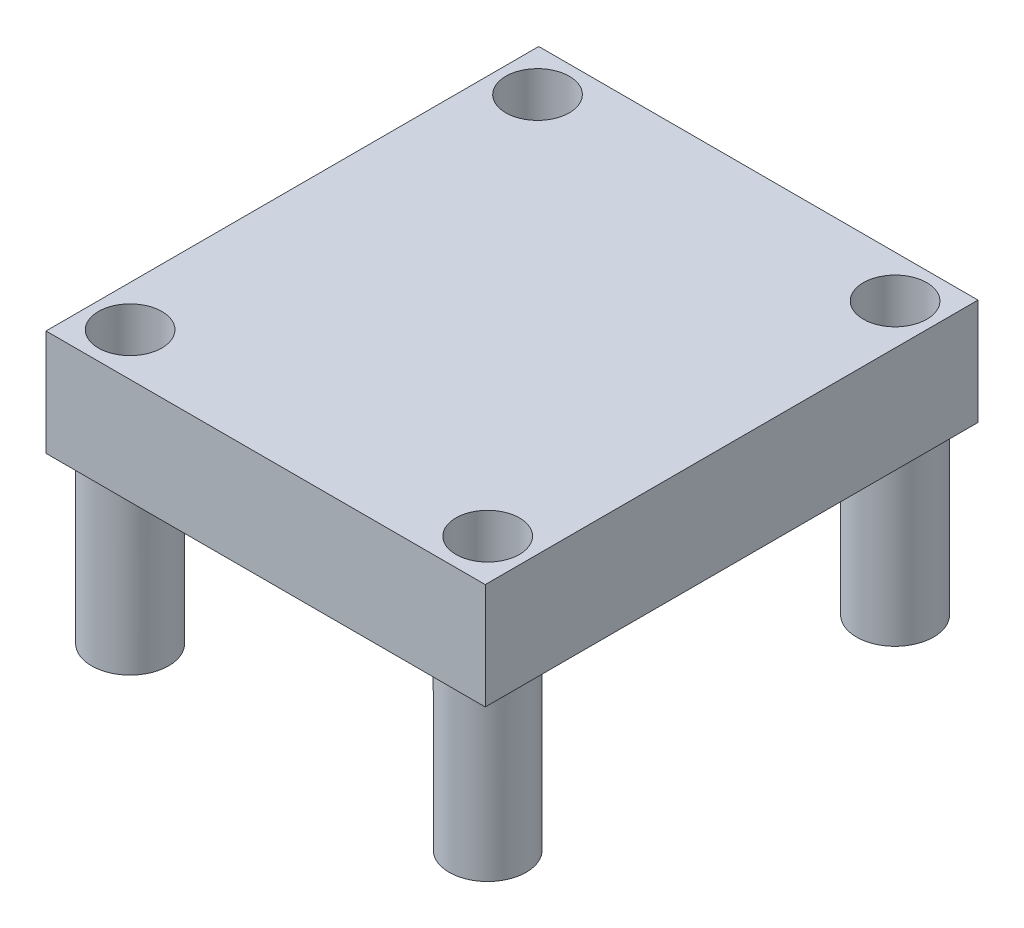
ISO-10303-21;
HEADER;
FILE_DESCRIPTION(('STEP AP214'),'2;1');
FILE_NAME('part.step','',(''),(''),'','','');
FILE_SCHEMA(('AUTOMOTIVE_DESIGN { 1 0 10303 214 1 1 1 1 }'));
ENDSEC;
DATA;
#1=APPLICATION_CONTEXT('core data for automotive mechanical design processes');
#2=APPLICATION_PROTOCOL_DEFINITION('international standard','automotive_design',2000,#1);
#3=PRODUCT_CONTEXT('',#1,'mechanical');
#4=PRODUCT('Part','Part','',(#3));
#5=PRODUCT_RELATED_PRODUCT_CATEGORY('part','',(#4));
#6=PRODUCT_DEFINITION_FORMATION('','',#4);
#7=PRODUCT_DEFINITION_CONTEXT('part definition',#1,'design');
#8=PRODUCT_DEFINITION('design','',#6,#7);
#9=PRODUCT_DEFINITION_SHAPE('','',#8);
#10=(LENGTH_UNIT() NAMED_UNIT(*) SI_UNIT(.MILLI.,.METRE.));
#11=(NAMED_UNIT(*) PLANE_ANGLE_UNIT() SI_UNIT($,.RADIAN.));
#12=(NAMED_UNIT(*) SI_UNIT($,.STERADIAN.) SOLID_ANGLE_UNIT());
#13=UNCERTAINTY_MEASURE_WITH_UNIT(LENGTH_MEASURE(1.E-05),#10,'distance_accuracy_value','');
#14=(GEOMETRIC_REPRESENTATION_CONTEXT(3) GLOBAL_UNCERTAINTY_ASSIGNED_CONTEXT((#13)) GLOBAL_UNIT_ASSIGNED_CONTEXT((#10,
#11,#12)) REPRESENTATION_CONTEXT('',''));
#15=CARTESIAN_POINT('',(0.,0.,0.));
#16=DIRECTION('',(0.,0.,1.));
#17=DIRECTION('',(1.,0.,0.));
#18=AXIS2_PLACEMENT_3D('',#15,#16,#17);
#19=CARTESIAN_POINT('',(-11.3076995509559,5.4864,-1.67311031433089));
#20=DIRECTION('',(0.,0.,1.));
#21=DIRECTION('',(1.,0.,0.));
#22=AXIS2_PLACEMENT_3D('',#19,#20,#21);
#23=PLANE('',#22);
#24=DIRECTION('',(-1.,0.,0.));
#25=VECTOR('',#24,1.);
#26=CARTESIAN_POINT('',(-11.3076995509559,0.,-1.67311031433089));
#27=LINE('',#26,#25);
#28=CARTESIAN_POINT('',(-11.3076995509559,0.,-1.67311031433089));
#29=VERTEX_POINT('',#28);
#30=CARTESIAN_POINT('',(-34.0406995509559,0.,-1.67311031433089));
#31=VERTEX_POINT('',#30);
#32=EDGE_CURVE('E103',#29,#31,#27,.T.);
#33=ORIENTED_EDGE('',*,*,#32,.T.);
#34=DIRECTION('',(0.,-1.,0.));
#35=VECTOR('',#34,1.);
#36=CARTESIAN_POINT('',(-34.0406995509559,5.4864,-1.67311031433089));
#37=LINE('',#36,#35);
#38=CARTESIAN_POINT('',(-34.0406995509559,5.4864,-1.67311031433089));
#39=VERTEX_POINT('',#38);
#40=EDGE_CURVE('E94',#39,#31,#37,.T.);
#41=ORIENTED_EDGE('',*,*,#40,.F.);
#42=DIRECTION('',(-1.,0.,0.));
#43=VECTOR('',#42,1.);
#44=CARTESIAN_POINT('',(-11.3076995509559,5.4864,-1.67311031433089));
#45=LINE('',#44,#43);
#46=CARTESIAN_POINT('',(-11.3076995509559,5.4864,-1.67311031433089));
#47=VERTEX_POINT('',#46);
#48=EDGE_CURVE('E88',#47,#39,#45,.T.);
#49=ORIENTED_EDGE('',*,*,#48,.F.);
#50=DIRECTION('',(0.,-1.,0.));
#51=VECTOR('',#50,1.);
#52=CARTESIAN_POINT('',(-11.3076995509559,5.4864,-1.67311031433089));
#53=LINE('',#52,#51);
#54=EDGE_CURVE('E99',#47,#29,#53,.T.);
#55=ORIENTED_EDGE('',*,*,#54,.T.);
#56=EDGE_LOOP('',(#33,#41,#49,#55));
#57=FACE_BOUND('',#56,.T.);
#58=ADVANCED_FACE('F36',(#57),#23,.F.);
#59=CARTESIAN_POINT('',(-34.0406995509559,5.4864,-1.67311031433089));
#60=DIRECTION('',(1.,0.,0.));
#61=DIRECTION('',(0.,0.,-1.));
#62=AXIS2_PLACEMENT_3D('',#59,#60,#61);
#63=PLANE('',#62);
#64=DIRECTION('',(0.,0.,1.));
#65=VECTOR('',#64,1.);
#66=CARTESIAN_POINT('',(-34.0406995509559,0.,-1.67311031433089));
#67=LINE('',#66,#65);
#68=CARTESIAN_POINT('',(-34.0406995509559,0.,23.8284896856691));
#69=VERTEX_POINT('',#68);
#70=EDGE_CURVE('E93',#31,#69,#67,.T.);
#71=ORIENTED_EDGE('',*,*,#70,.T.);
#72=DIRECTION('',(0.,-1.,0.));
#73=VECTOR('',#72,1.);
#74=CARTESIAN_POINT('',(-34.0406995509559,5.4864,23.8284896856691));
#75=LINE('',#74,#73);
#76=CARTESIAN_POINT('',(-34.0406995509559,5.4864,23.8284896856691));
#77=VERTEX_POINT('',#76);
#78=EDGE_CURVE('E91',#77,#69,#75,.T.);
#79=ORIENTED_EDGE('',*,*,#78,.F.);
#80=DIRECTION('',(0.,0.,1.));
#81=VECTOR('',#80,1.);
#82=CARTESIAN_POINT('',(-34.0406995509559,5.4864,-1.67311031433089));
#83=LINE('',#82,#81);
#84=EDGE_CURVE('E83',#39,#77,#83,.T.);
#85=ORIENTED_EDGE('',*,*,#84,.F.);
#86=ORIENTED_EDGE('',*,*,#40,.T.);
#87=EDGE_LOOP('',(#71,#79,#85,#86));
#88=FACE_BOUND('',#87,.T.);
#89=ADVANCED_FACE('F92',(#88),#63,.F.);
#90=CARTESIAN_POINT('',(-34.0406995509559,5.4864,23.8284896856691));
#91=DIRECTION('',(0.,0.,-1.));
#92=DIRECTION('',(-1.,0.,0.));
#93=AXIS2_PLACEMENT_3D('',#90,#91,#92);
#94=PLANE('',#93);
#95=DIRECTION('',(1.,0.,0.));
#96=VECTOR('',#95,1.);
#97=CARTESIAN_POINT('',(-34.0406995509559,0.,23.8284896856691));
#98=LINE('',#97,#96);
#99=CARTESIAN_POINT('',(-11.3076995509559,0.,23.8284896856691));
#100=VERTEX_POINT('',#99);
#101=EDGE_CURVE('E69',#69,#100,#98,.T.);
#102=ORIENTED_EDGE('',*,*,#101,.T.);
#103=DIRECTION('',(0.,-1.,0.));
#104=VECTOR('',#103,1.);
#105=CARTESIAN_POINT('',(-11.3076995509559,5.4864,23.8284896856691));
#106=LINE('',#105,#104);
#107=CARTESIAN_POINT('',(-11.3076995509559,5.4864,23.8284896856691));
#108=VERTEX_POINT('',#107);
#109=EDGE_CURVE('E95',#108,#100,#106,.T.);
#110=ORIENTED_EDGE('',*,*,#109,.F.);
#111=DIRECTION('',(1.,0.,0.));
#112=VECTOR('',#111,1.);
#113=CARTESIAN_POINT('',(-34.0406995509559,5.4864,23.8284896856691));
#114=LINE('',#113,#112);
#115=EDGE_CURVE('E86',#77,#108,#114,.T.);
#116=ORIENTED_EDGE('',*,*,#115,.F.);
#117=ORIENTED_EDGE('',*,*,#78,.T.);
#118=EDGE_LOOP('',(#102,#110,#116,#117));
#119=FACE_BOUND('',#118,.T.);
#120=ADVANCED_FACE('F97',(#119),#94,.F.);
#121=CARTESIAN_POINT('',(-11.3076995509559,5.4864,23.8284896856691));
#122=DIRECTION('',(-1.,0.,0.));
#123=DIRECTION('',(0.,0.,1.));
#124=AXIS2_PLACEMENT_3D('',#121,#122,#123);
#125=PLANE('',#124);
#126=DIRECTION('',(0.,0.,-1.));
#127=VECTOR('',#126,1.);
#128=CARTESIAN_POINT('',(-11.3076995509559,0.,23.8284896856691));
#129=LINE('',#128,#127);
#130=EDGE_CURVE('E75',#100,#29,#129,.T.);
#131=ORIENTED_EDGE('',*,*,#130,.T.);
#132=ORIENTED_EDGE('',*,*,#54,.F.);
#133=DIRECTION('',(0.,0.,-1.));
#134=VECTOR('',#133,1.);
#135=CARTESIAN_POINT('',(-11.3076995509559,5.4864,23.8284896856691));
#136=LINE('',#135,#134);
#137=EDGE_CURVE('E52',#108,#47,#136,.T.);
#138=ORIENTED_EDGE('',*,*,#137,.F.);
#139=ORIENTED_EDGE('',*,*,#109,.T.);
#140=EDGE_LOOP('',(#131,#132,#138,#139));
#141=FACE_BOUND('',#140,.T.);
#142=ADVANCED_FACE('F135',(#141),#125,.F.);
#143=CARTESIAN_POINT('',(0.,5.4864,0.));
#144=DIRECTION('',(0.,1.,0.));
#145=DIRECTION('',(0.,0.,1.));
#146=AXIS2_PLACEMENT_3D('',#143,#144,#145);
#147=PLANE('',#146);
#148=CARTESIAN_POINT('',(-31.9184975647169,5.4864,21.596793601497));
#149=DIRECTION('',(0.,1.,0.));
#150=DIRECTION('',(0.,0.,1.));
#151=AXIS2_PLACEMENT_3D('',#148,#149,#150);
#152=CIRCLE('',#151,1.642387971988);
#153=CARTESIAN_POINT('',(-31.9184975647169,5.4864,23.239181573485));
#154=VERTEX_POINT('',#153);
#155=EDGE_CURVE('E363',#154,#154,#152,.T.);
#156=ORIENTED_EDGE('',*,*,#155,.F.);
#157=EDGE_LOOP('',(#156));
#158=FACE_BOUND('',#157,.T.);
#159=CARTESIAN_POINT('',(-13.4142597469854,5.4864,21.596793601497));
#160=DIRECTION('',(0.,1.,0.));
#161=DIRECTION('',(0.,0.,1.));
#162=AXIS2_PLACEMENT_3D('',#159,#160,#161);
#163=CIRCLE('',#162,1.64238797198801);
#164=CARTESIAN_POINT('',(-13.4142597469854,5.4864,23.239181573485));
#165=VERTEX_POINT('',#164);
#166=EDGE_CURVE('E358',#165,#165,#163,.T.);
#167=ORIENTED_EDGE('',*,*,#166,.F.);
#168=EDGE_LOOP('',(#167));
#169=FACE_BOUND('',#168,.T.);
#170=CARTESIAN_POINT('',(-13.4142597469854,5.4864,0.511660399212977));
#171=DIRECTION('',(0.,1.,0.));
#172=DIRECTION('',(0.,0.,1.));
#173=AXIS2_PLACEMENT_3D('',#170,#171,#172);
#174=CIRCLE('',#173,1.642387971988);
#175=CARTESIAN_POINT('',(-13.4142597469854,5.4864,2.15404837120098));
#176=VERTEX_POINT('',#175);
#177=EDGE_CURVE('E353',#176,#176,#174,.T.);
#178=ORIENTED_EDGE('',*,*,#177,.F.);
#179=EDGE_LOOP('',(#178));
#180=FACE_BOUND('',#179,.T.);
#181=CARTESIAN_POINT('',(-31.9184975647169,5.4864,0.511660399212977));
#182=DIRECTION('',(0.,1.,0.));
#183=DIRECTION('',(0.,0.,1.));
#184=AXIS2_PLACEMENT_3D('',#181,#182,#183);
#185=CIRCLE('',#184,1.642387971988);
#186=CARTESIAN_POINT('',(-31.9184975647169,5.4864,2.15404837120098));
#187=VERTEX_POINT('',#186);
#188=EDGE_CURVE('E355',#187,#187,#185,.T.);
#189=ORIENTED_EDGE('',*,*,#188,.F.);
#190=EDGE_LOOP('',(#189));
#191=FACE_BOUND('',#190,.T.);
#192=ORIENTED_EDGE('',*,*,#48,.T.);
#193=ORIENTED_EDGE('',*,*,#84,.T.);
#194=ORIENTED_EDGE('',*,*,#115,.T.);
#195=ORIENTED_EDGE('',*,*,#137,.T.);
#196=EDGE_LOOP('',(#192,#193,#194,#195));
#197=FACE_BOUND('',#196,.T.);
#198=ADVANCED_FACE('F84',(#158,#169,#180,#191,#197),#147,.T.);
#199=CARTESIAN_POINT('',(0.,0.,0.));
#200=DIRECTION('',(0.,1.,0.));
#201=DIRECTION('',(0.,0.,1.));
#202=AXIS2_PLACEMENT_3D('',#199,#200,#201);
#203=PLANE('',#202);
#204=CARTESIAN_POINT('',(-13.4142597469854,0.,0.511660399212977));
#205=DIRECTION('',(0.,1.,0.));
#206=DIRECTION('',(0.,0.,1.));
#207=AXIS2_PLACEMENT_3D('',#204,#205,#206);
#208=CIRCLE('',#207,1.9939);
#209=CARTESIAN_POINT('',(-13.4142597469854,0.,2.50556039921298));
#210=VERTEX_POINT('',#209);
#211=EDGE_CURVE('E11',#210,#210,#208,.F.);
#212=ORIENTED_EDGE('',*,*,#211,.F.);
#213=EDGE_LOOP('',(#212));
#214=FACE_BOUND('',#213,.T.);
#215=CARTESIAN_POINT('',(-31.9184975647169,0.,0.511660399212977));
#216=DIRECTION('',(0.,1.,0.));
#217=DIRECTION('',(0.,0.,1.));
#218=AXIS2_PLACEMENT_3D('',#215,#216,#217);
#219=CIRCLE('',#218,1.9939);
#220=CARTESIAN_POINT('',(-31.9184975647169,0.,2.50556039921298));
#221=VERTEX_POINT('',#220);
#222=EDGE_CURVE('E44',#221,#221,#219,.F.);
#223=ORIENTED_EDGE('',*,*,#222,.F.);
#224=EDGE_LOOP('',(#223));
#225=FACE_BOUND('',#224,.T.);
#226=CARTESIAN_POINT('',(-13.4142597469854,0.,21.596793601497));
#227=DIRECTION('',(0.,1.,0.));
#228=DIRECTION('',(0.,0.,1.));
#229=AXIS2_PLACEMENT_3D('',#226,#227,#228);
#230=CIRCLE('',#229,1.9939);
#231=CARTESIAN_POINT('',(-13.4142597469854,0.,23.590693601497));
#232=VERTEX_POINT('',#231);
#233=EDGE_CURVE('E116',#232,#232,#230,.F.);
#234=ORIENTED_EDGE('',*,*,#233,.F.);
#235=EDGE_LOOP('',(#234));
#236=FACE_BOUND('',#235,.T.);
#237=CARTESIAN_POINT('',(-31.9184975647169,0.,21.596793601497));
#238=DIRECTION('',(0.,1.,0.));
#239=DIRECTION('',(0.,0.,1.));
#240=AXIS2_PLACEMENT_3D('',#237,#238,#239);
#241=CIRCLE('',#240,1.9939);
#242=CARTESIAN_POINT('',(-31.9184975647169,0.,23.590693601497));
#243=VERTEX_POINT('',#242);
#244=EDGE_CURVE('E113',#243,#243,#241,.F.);
#245=ORIENTED_EDGE('',*,*,#244,.F.);
#246=EDGE_LOOP('',(#245));
#247=FACE_BOUND('',#246,.T.);
#248=ORIENTED_EDGE('',*,*,#32,.F.);
#249=ORIENTED_EDGE('',*,*,#130,.F.);
#250=ORIENTED_EDGE('',*,*,#101,.F.);
#251=ORIENTED_EDGE('',*,*,#70,.F.);
#252=EDGE_LOOP('',(#248,#249,#250,#251));
#253=FACE_BOUND('',#252,.T.);
#254=ADVANCED_FACE('F123',(#214,#225,#236,#247,#253),#203,.F.);
#255=CARTESIAN_POINT('',(-31.9184975647169,-8.5852,21.596793601497));
#256=DIRECTION('',(0.,-1.,0.));
#257=DIRECTION('',(0.,0.,-1.));
#258=AXIS2_PLACEMENT_3D('',#255,#256,#257);
#259=PLANE('',#258);
#260=CARTESIAN_POINT('',(-31.9184975647169,-8.5852,21.596793601497));
#261=DIRECTION('',(0.,-1.,0.));
#262=DIRECTION('',(0.,0.,-1.));
#263=AXIS2_PLACEMENT_3D('',#260,#261,#262);
#264=CIRCLE('',#263,1.9939);
#265=CARTESIAN_POINT('',(-31.9184975647169,-8.5852,19.602893601497));
#266=VERTEX_POINT('',#265);
#267=EDGE_CURVE('E106',#266,#266,#264,.T.);
#268=ORIENTED_EDGE('',*,*,#267,.T.);
#269=EDGE_LOOP('',(#268));
#270=FACE_BOUND('',#269,.T.);
#271=CARTESIAN_POINT('',(-31.9184975647169,-8.5852,21.596793601497));
#272=DIRECTION('',(0.,-1.,0.));
#273=DIRECTION('',(0.,0.,-1.));
#274=AXIS2_PLACEMENT_3D('',#271,#272,#273);
#275=CIRCLE('',#274,1.642387971988);
#276=CARTESIAN_POINT('',(-31.9184975647169,-8.5852,19.954405629509));
#277=VERTEX_POINT('',#276);
#278=EDGE_CURVE('E382',#277,#277,#275,.T.);
#279=ORIENTED_EDGE('',*,*,#278,.F.);
#280=EDGE_LOOP('',(#279));
#281=FACE_BOUND('',#280,.T.);
#282=ADVANCED_FACE('F126',(#270,#281),#259,.T.);
#283=CARTESIAN_POINT('',(-31.9184975647169,-8.5852,21.596793601497));
#284=DIRECTION('',(0.,1.,0.));
#285=DIRECTION('',(0.,0.,1.));
#286=AXIS2_PLACEMENT_3D('',#283,#284,#285);
#287=CYLINDRICAL_SURFACE('',#286,1.9939);
#288=ORIENTED_EDGE('',*,*,#267,.F.);
#289=EDGE_LOOP('',(#288));
#290=FACE_BOUND('',#289,.T.);
#291=ORIENTED_EDGE('',*,*,#244,.T.);
#292=EDGE_LOOP('',(#291));
#293=FACE_BOUND('',#292,.T.);
#294=ADVANCED_FACE('F178',(#290,#293),#287,.T.);
#295=CARTESIAN_POINT('',(-31.9184975647169,-8.5852,21.596793601497));
#296=DIRECTION('',(0.,1.,0.));
#297=DIRECTION('',(0.,0.,1.));
#298=AXIS2_PLACEMENT_3D('',#295,#296,#297);
#299=CYLINDRICAL_SURFACE('',#298,1.642387971988);
#300=ORIENTED_EDGE('',*,*,#278,.T.);
#301=EDGE_LOOP('',(#300));
#302=FACE_BOUND('',#301,.T.);
#303=ORIENTED_EDGE('',*,*,#155,.T.);
#304=EDGE_LOOP('',(#303));
#305=FACE_BOUND('',#304,.T.);
#306=ADVANCED_FACE('F189',(#302,#305),#299,.F.);
#307=CARTESIAN_POINT('',(-13.4142597469854,-8.5852,21.596793601497));
#308=DIRECTION('',(0.,-1.,0.));
#309=DIRECTION('',(0.,0.,-1.));
#310=AXIS2_PLACEMENT_3D('',#307,#308,#309);
#311=PLANE('',#310);
#312=CARTESIAN_POINT('',(-13.4142597469854,-8.5852,21.596793601497));
#313=DIRECTION('',(0.,-1.,0.));
#314=DIRECTION('',(0.,0.,-1.));
#315=AXIS2_PLACEMENT_3D('',#312,#313,#314);
#316=CIRCLE('',#315,1.9939);
#317=CARTESIAN_POINT('',(-13.4142597469854,-8.5852,19.602893601497));
#318=VERTEX_POINT('',#317);
#319=EDGE_CURVE('E376',#318,#318,#316,.T.);
#320=ORIENTED_EDGE('',*,*,#319,.T.);
#321=EDGE_LOOP('',(#320));
#322=FACE_BOUND('',#321,.T.);
#323=CARTESIAN_POINT('',(-13.4142597469854,-8.5852,21.596793601497));
#324=DIRECTION('',(0.,-1.,0.));
#325=DIRECTION('',(0.,0.,-1.));
#326=AXIS2_PLACEMENT_3D('',#323,#324,#325);
#327=CIRCLE('',#326,1.64238797198801);
#328=CARTESIAN_POINT('',(-13.4142597469854,-8.5852,19.954405629509));
#329=VERTEX_POINT('',#328);
#330=EDGE_CURVE('E379',#329,#329,#327,.T.);
#331=ORIENTED_EDGE('',*,*,#330,.F.);
#332=EDGE_LOOP('',(#331));
#333=FACE_BOUND('',#332,.T.);
#334=ADVANCED_FACE('F198',(#322,#333),#311,.T.);
#335=CARTESIAN_POINT('',(-13.4142597469854,-8.5852,21.596793601497));
#336=DIRECTION('',(0.,1.,0.));
#337=DIRECTION('',(0.,0.,1.));
#338=AXIS2_PLACEMENT_3D('',#335,#336,#337);
#339=CYLINDRICAL_SURFACE('',#338,1.9939);
#340=ORIENTED_EDGE('',*,*,#319,.F.);
#341=EDGE_LOOP('',(#340));
#342=FACE_BOUND('',#341,.T.);
#343=ORIENTED_EDGE('',*,*,#233,.T.);
#344=EDGE_LOOP('',(#343));
#345=FACE_BOUND('',#344,.T.);
#346=ADVANCED_FACE('F203',(#342,#345),#339,.T.);
#347=CARTESIAN_POINT('',(-13.4142597469854,-8.5852,21.596793601497));
#348=DIRECTION('',(0.,1.,0.));
#349=DIRECTION('',(0.,0.,1.));
#350=AXIS2_PLACEMENT_3D('',#347,#348,#349);
#351=CYLINDRICAL_SURFACE('',#350,1.64238797198801);
#352=ORIENTED_EDGE('',*,*,#330,.T.);
#353=EDGE_LOOP('',(#352));
#354=FACE_BOUND('',#353,.T.);
#355=ORIENTED_EDGE('',*,*,#166,.T.);
#356=EDGE_LOOP('',(#355));
#357=FACE_BOUND('',#356,.T.);
#358=ADVANCED_FACE('F214',(#354,#357),#351,.F.);
#359=CARTESIAN_POINT('',(-31.9184975647169,-8.5852,0.511660399212977));
#360=DIRECTION('',(0.,-1.,0.));
#361=DIRECTION('',(0.,0.,-1.));
#362=AXIS2_PLACEMENT_3D('',#359,#360,#361);
#363=PLANE('',#362);
#364=CARTESIAN_POINT('',(-31.9184975647169,-8.5852,0.511660399212977));
#365=DIRECTION('',(0.,-1.,0.));
#366=DIRECTION('',(0.,0.,-1.));
#367=AXIS2_PLACEMENT_3D('',#364,#365,#366);
#368=CIRCLE('',#367,1.9939);
#369=CARTESIAN_POINT('',(-31.9184975647169,-8.5852,-1.48223960078702));
#370=VERTEX_POINT('',#369);
#371=EDGE_CURVE('E370',#370,#370,#368,.T.);
#372=ORIENTED_EDGE('',*,*,#371,.T.);
#373=EDGE_LOOP('',(#372));
#374=FACE_BOUND('',#373,.T.);
#375=CARTESIAN_POINT('',(-31.9184975647169,-8.5852,0.511660399212977));
#376=DIRECTION('',(0.,-1.,0.));
#377=DIRECTION('',(0.,0.,-1.));
#378=AXIS2_PLACEMENT_3D('',#375,#376,#377);
#379=CIRCLE('',#378,1.642387971988);
#380=CARTESIAN_POINT('',(-31.9184975647169,-8.5852,-1.13072757277503));
#381=VERTEX_POINT('',#380);
#382=EDGE_CURVE('E373',#381,#381,#379,.T.);
#383=ORIENTED_EDGE('',*,*,#382,.F.);
#384=EDGE_LOOP('',(#383));
#385=FACE_BOUND('',#384,.T.);
#386=ADVANCED_FACE('F223',(#374,#385),#363,.T.);
#387=CARTESIAN_POINT('',(-31.9184975647169,-8.5852,0.511660399212977));
#388=DIRECTION('',(0.,1.,0.));
#389=DIRECTION('',(0.,0.,1.));
#390=AXIS2_PLACEMENT_3D('',#387,#388,#389);
#391=CYLINDRICAL_SURFACE('',#390,1.9939);
#392=ORIENTED_EDGE('',*,*,#371,.F.);
#393=EDGE_LOOP('',(#392));
#394=FACE_BOUND('',#393,.T.);
#395=ORIENTED_EDGE('',*,*,#222,.T.);
#396=EDGE_LOOP('',(#395));
#397=FACE_BOUND('',#396,.T.);
#398=ADVANCED_FACE('F121',(#394,#397),#391,.T.);
#399=CARTESIAN_POINT('',(-31.9184975647169,-8.5852,0.511660399212977));
#400=DIRECTION('',(0.,1.,0.));
#401=DIRECTION('',(0.,0.,1.));
#402=AXIS2_PLACEMENT_3D('',#399,#400,#401);
#403=CYLINDRICAL_SURFACE('',#402,1.642387971988);
#404=ORIENTED_EDGE('',*,*,#382,.T.);
#405=EDGE_LOOP('',(#404));
#406=FACE_BOUND('',#405,.T.);
#407=ORIENTED_EDGE('',*,*,#188,.T.);
#408=EDGE_LOOP('',(#407));
#409=FACE_BOUND('',#408,.T.);
#410=ADVANCED_FACE('F238',(#406,#409),#403,.F.);
#411=CARTESIAN_POINT('',(-13.4142597469854,-8.5852,0.511660399212977));
#412=DIRECTION('',(0.,-1.,0.));
#413=DIRECTION('',(0.,0.,-1.));
#414=AXIS2_PLACEMENT_3D('',#411,#412,#413);
#415=PLANE('',#414);
#416=CARTESIAN_POINT('',(-13.4142597469854,-8.5852,0.511660399212977));
#417=DIRECTION('',(0.,-1.,0.));
#418=DIRECTION('',(0.,0.,-1.));
#419=AXIS2_PLACEMENT_3D('',#416,#417,#418);
#420=CIRCLE('',#419,1.9939);
#421=CARTESIAN_POINT('',(-13.4142597469854,-8.5852,-1.48223960078702));
#422=VERTEX_POINT('',#421);
#423=EDGE_CURVE('E366',#422,#422,#420,.T.);
#424=ORIENTED_EDGE('',*,*,#423,.T.);
#425=EDGE_LOOP('',(#424));
#426=FACE_BOUND('',#425,.T.);
#427=CARTESIAN_POINT('',(-13.4142597469854,-8.5852,0.511660399212977));
#428=DIRECTION('',(0.,-1.,0.));
#429=DIRECTION('',(0.,0.,-1.));
#430=AXIS2_PLACEMENT_3D('',#427,#428,#429);
#431=CIRCLE('',#430,1.642387971988);
#432=CARTESIAN_POINT('',(-13.4142597469854,-8.5852,-1.13072757277503));
#433=VERTEX_POINT('',#432);
#434=EDGE_CURVE('E350',#433,#433,#431,.T.);
#435=ORIENTED_EDGE('',*,*,#434,.F.);
#436=EDGE_LOOP('',(#435));
#437=FACE_BOUND('',#436,.T.);
#438=ADVANCED_FACE('F247',(#426,#437),#415,.T.);
#439=CARTESIAN_POINT('',(-13.4142597469854,-8.5852,0.511660399212977));
#440=DIRECTION('',(0.,1.,0.));
#441=DIRECTION('',(0.,0.,1.));
#442=AXIS2_PLACEMENT_3D('',#439,#440,#441);
#443=CYLINDRICAL_SURFACE('',#442,1.9939);
#444=ORIENTED_EDGE('',*,*,#423,.F.);
#445=EDGE_LOOP('',(#444));
#446=FACE_BOUND('',#445,.T.);
#447=ORIENTED_EDGE('',*,*,#211,.T.);
#448=EDGE_LOOP('',(#447));
#449=FACE_BOUND('',#448,.T.);
#450=ADVANCED_FACE('F252',(#446,#449),#443,.T.);
#451=CARTESIAN_POINT('',(-13.4142597469854,-8.5852,0.511660399212977));
#452=DIRECTION('',(0.,1.,0.));
#453=DIRECTION('',(0.,0.,1.));
#454=AXIS2_PLACEMENT_3D('',#451,#452,#453);
#455=CYLINDRICAL_SURFACE('',#454,1.642387971988);
#456=ORIENTED_EDGE('',*,*,#434,.T.);
#457=EDGE_LOOP('',(#456));
#458=FACE_BOUND('',#457,.T.);
#459=ORIENTED_EDGE('',*,*,#177,.T.);
#460=EDGE_LOOP('',(#459));
#461=FACE_BOUND('',#460,.T.);
#462=ADVANCED_FACE('F263',(#458,#461),#455,.F.);
#463=CLOSED_SHELL('',(#58,#89,#120,#142,#198,#254,#282,#294,#306,#334,#346,#358,#386,#398,#410,
#438,#450,#462));
#464=MANIFOLD_SOLID_BREP('B2',#463);
#465=ADVANCED_BREP_SHAPE_REPRESENTATION('',(#18,#464),#14);
#466=SHAPE_DEFINITION_REPRESENTATION(#9,#465);
ENDSEC;
END-ISO-10303-21;
